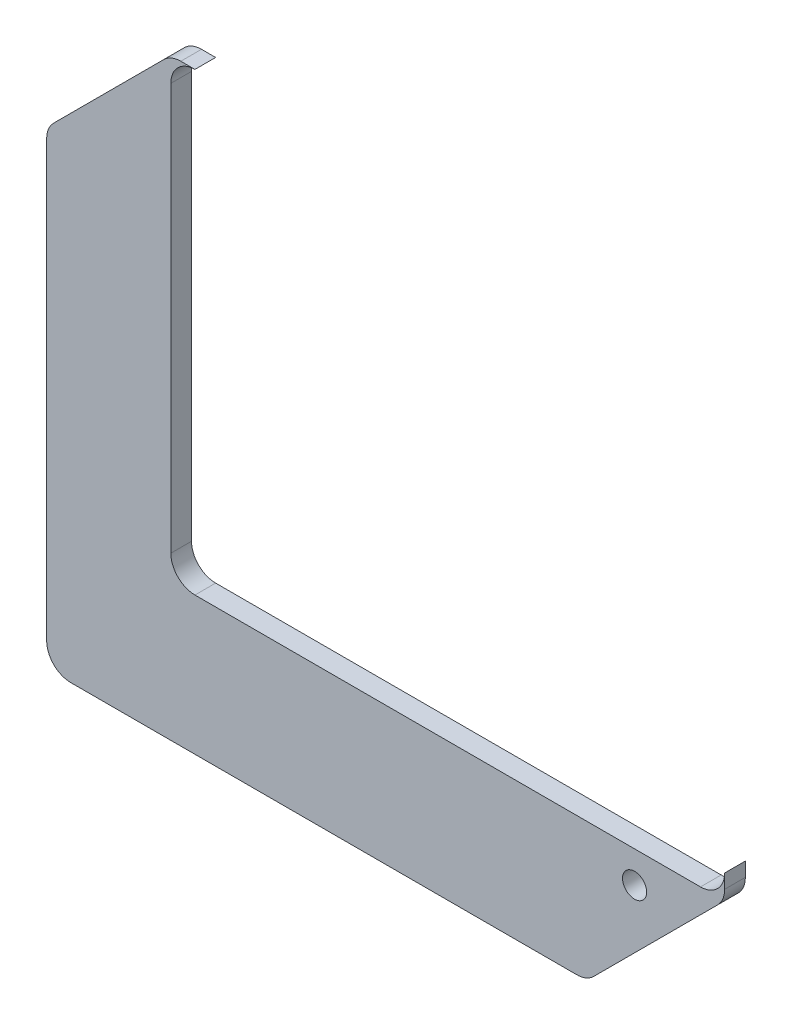
ISO-10303-21;
HEADER;
FILE_DESCRIPTION(('STEP AP214'),'2;1');
FILE_NAME('part.step','',(''),(''),'','','');
FILE_SCHEMA(('AUTOMOTIVE_DESIGN { 1 0 10303 214 1 1 1 1 }'));
ENDSEC;
DATA;
#1=APPLICATION_CONTEXT('core data for automotive mechanical design processes');
#2=APPLICATION_PROTOCOL_DEFINITION('international standard','automotive_design',2000,#1);
#3=PRODUCT_CONTEXT('',#1,'mechanical');
#4=PRODUCT('Part','Part','',(#3));
#5=PRODUCT_RELATED_PRODUCT_CATEGORY('part','',(#4));
#6=PRODUCT_DEFINITION_FORMATION('','',#4);
#7=PRODUCT_DEFINITION_CONTEXT('part definition',#1,'design');
#8=PRODUCT_DEFINITION('design','',#6,#7);
#9=PRODUCT_DEFINITION_SHAPE('','',#8);
#10=(LENGTH_UNIT() NAMED_UNIT(*) SI_UNIT(.MILLI.,.METRE.));
#11=(NAMED_UNIT(*) PLANE_ANGLE_UNIT() SI_UNIT($,.RADIAN.));
#12=(NAMED_UNIT(*) SI_UNIT($,.STERADIAN.) SOLID_ANGLE_UNIT());
#13=UNCERTAINTY_MEASURE_WITH_UNIT(LENGTH_MEASURE(1.E-05),#10,'distance_accuracy_value','');
#14=(GEOMETRIC_REPRESENTATION_CONTEXT(3) GLOBAL_UNCERTAINTY_ASSIGNED_CONTEXT((#13)) GLOBAL_UNIT_ASSIGNED_CONTEXT((#10,
#11,#12)) REPRESENTATION_CONTEXT('',''));
#15=CARTESIAN_POINT('',(0.,0.,0.));
#16=DIRECTION('',(0.,0.,1.));
#17=DIRECTION('',(1.,0.,0.));
#18=AXIS2_PLACEMENT_3D('',#15,#16,#17);
#19=CARTESIAN_POINT('',(40.1499999999999,-40.15,3.));
#20=DIRECTION('',(-0.707106781186546,0.707106781186548,0.));
#21=DIRECTION('',(-0.707106781186549,-0.707106781186546,0.));
#22=AXIS2_PLACEMENT_3D('',#19,#20,#21);
#23=PLANE('',#22);
#24=DIRECTION('',(0.707106781186549,0.707106781186546,0.));
#25=VECTOR('',#24,1.);
#26=CARTESIAN_POINT('',(40.1499999999999,-40.15,0.));
#27=LINE('',#26,#25);
#28=CARTESIAN_POINT('',(61.325126265847,-18.9748737341529,0.));
#29=VERTEX_POINT('',#28);
#30=CARTESIAN_POINT('',(79.2748737341529,-1.02512626584707,0.));
#31=VERTEX_POINT('',#30);
#32=EDGE_CURVE('E188',#29,#31,#27,.T.);
#33=ORIENTED_EDGE('',*,*,#32,.T.);
#34=DIRECTION('',(0.,0.,-1.));
#35=VECTOR('',#34,1.);
#36=CARTESIAN_POINT('',(79.2748737341529,-1.02512626584707,3.));
#37=LINE('',#36,#35);
#38=CARTESIAN_POINT('',(79.2748737341529,-1.02512626584707,3.));
#39=VERTEX_POINT('',#38);
#40=EDGE_CURVE('E241',#31,#39,#37,.F.);
#41=ORIENTED_EDGE('',*,*,#40,.T.);
#42=DIRECTION('',(0.707106781186549,0.707106781186546,0.));
#43=VECTOR('',#42,1.);
#44=CARTESIAN_POINT('',(40.1499999999999,-40.15,3.));
#45=LINE('',#44,#43);
#46=CARTESIAN_POINT('',(61.325126265847,-18.9748737341529,3.));
#47=VERTEX_POINT('',#46);
#48=EDGE_CURVE('E192',#47,#39,#45,.T.);
#49=ORIENTED_EDGE('',*,*,#48,.F.);
#50=DIRECTION('',(0.,0.,-1.));
#51=VECTOR('',#50,1.);
#52=CARTESIAN_POINT('',(61.325126265847,-18.9748737341529,3.));
#53=LINE('',#52,#51);
#54=EDGE_CURVE('E238',#47,#29,#53,.T.);
#55=ORIENTED_EDGE('',*,*,#54,.T.);
#56=EDGE_LOOP('',(#33,#41,#49,#55));
#57=FACE_BOUND('',#56,.T.);
#58=ADVANCED_FACE('F34',(#57),#23,.F.);
#59=CARTESIAN_POINT('',(80.3,0.,3.));
#60=DIRECTION('',(-1.,0.,0.));
#61=DIRECTION('',(0.,0.,1.));
#62=AXIS2_PLACEMENT_3D('',#59,#60,#61);
#63=PLANE('',#62);
#64=DIRECTION('',(0.,1.,0.));
#65=VECTOR('',#64,1.);
#66=CARTESIAN_POINT('',(80.3,0.,0.));
#67=LINE('',#66,#65);
#68=CARTESIAN_POINT('',(80.3,1.44974746830586,0.));
#69=VERTEX_POINT('',#68);
#70=CARTESIAN_POINT('',(80.3,3.50000000000001,0.));
#71=VERTEX_POINT('',#70);
#72=EDGE_CURVE('E214',#69,#71,#67,.T.);
#73=ORIENTED_EDGE('',*,*,#72,.T.);
#74=DIRECTION('',(0.,0.,1.));
#75=VECTOR('',#74,1.);
#76=CARTESIAN_POINT('',(80.3,3.50000000000001,0.));
#77=LINE('',#76,#75);
#78=CARTESIAN_POINT('',(80.3,3.50000000000001,3.));
#79=VERTEX_POINT('',#78);
#80=EDGE_CURVE('E165',#71,#79,#77,.T.);
#81=ORIENTED_EDGE('',*,*,#80,.T.);
#82=DIRECTION('',(0.,1.,0.));
#83=VECTOR('',#82,1.);
#84=CARTESIAN_POINT('',(80.3,0.,3.));
#85=LINE('',#84,#83);
#86=CARTESIAN_POINT('',(80.3,1.44974746830586,3.));
#87=VERTEX_POINT('',#86);
#88=EDGE_CURVE('E195',#87,#79,#85,.T.);
#89=ORIENTED_EDGE('',*,*,#88,.F.);
#90=DIRECTION('',(0.,0.,-1.));
#91=VECTOR('',#90,1.);
#92=CARTESIAN_POINT('',(80.3,1.44974746830586,3.));
#93=LINE('',#92,#91);
#94=EDGE_CURVE('E211',#87,#69,#93,.T.);
#95=ORIENTED_EDGE('',*,*,#94,.T.);
#96=EDGE_LOOP('',(#73,#81,#89,#95));
#97=FACE_BOUND('',#96,.T.);
#98=ADVANCED_FACE('F277',(#97),#63,.F.);
#99=CARTESIAN_POINT('',(0.,66.,3.));
#100=DIRECTION('',(0.,1.,0.));
#101=DIRECTION('',(0.,0.,1.));
#102=AXIS2_PLACEMENT_3D('',#99,#100,#101);
#103=PLANE('',#102);
#104=DIRECTION('',(0.,0.,1.));
#105=VECTOR('',#104,1.);
#106=CARTESIAN_POINT('',(3.5,66.,0.));
#107=LINE('',#106,#105);
#108=CARTESIAN_POINT('',(3.5,66.,0.));
#109=VERTEX_POINT('',#108);
#110=CARTESIAN_POINT('',(3.5,66.,3.));
#111=VERTEX_POINT('',#110);
#112=EDGE_CURVE('E189',#109,#111,#107,.T.);
#113=ORIENTED_EDGE('',*,*,#112,.F.);
#114=DIRECTION('',(1.,0.,0.));
#115=VECTOR('',#114,1.);
#116=CARTESIAN_POINT('',(0.,66.,0.));
#117=LINE('',#116,#115);
#118=CARTESIAN_POINT('',(1.44974746830583,66.,0.));
#119=VERTEX_POINT('',#118);
#120=EDGE_CURVE('E216',#119,#109,#117,.T.);
#121=ORIENTED_EDGE('',*,*,#120,.F.);
#122=DIRECTION('',(0.,0.,-1.));
#123=VECTOR('',#122,1.);
#124=CARTESIAN_POINT('',(1.44974746830583,66.,3.));
#125=LINE('',#124,#123);
#126=CARTESIAN_POINT('',(1.44974746830583,66.,3.));
#127=VERTEX_POINT('',#126);
#128=EDGE_CURVE('E268',#119,#127,#125,.F.);
#129=ORIENTED_EDGE('',*,*,#128,.T.);
#130=DIRECTION('',(1.,0.,0.));
#131=VECTOR('',#130,1.);
#132=CARTESIAN_POINT('',(0.,66.,3.));
#133=LINE('',#132,#131);
#134=EDGE_CURVE('E199',#127,#111,#133,.T.);
#135=ORIENTED_EDGE('',*,*,#134,.T.);
#136=EDGE_LOOP('',(#113,#121,#129,#135));
#137=FACE_BOUND('',#136,.T.);
#138=ADVANCED_FACE('F321',(#137),#103,.T.);
#139=CARTESIAN_POINT('',(-33.,33.0000000000001,3.));
#140=DIRECTION('',(0.707106781186546,-0.707106781186548,0.));
#141=DIRECTION('',(0.707106781186549,0.707106781186546,0.));
#142=AXIS2_PLACEMENT_3D('',#139,#140,#141);
#143=PLANE('',#142);
#144=DIRECTION('',(-0.707106781186549,-0.707106781186546,0.));
#145=VECTOR('',#144,1.);
#146=CARTESIAN_POINT('',(-33.,33.0000000000001,0.));
#147=LINE('',#146,#145);
#148=CARTESIAN_POINT('',(-1.02512626584708,64.9748737341529,0.));
#149=VERTEX_POINT('',#148);
#150=CARTESIAN_POINT('',(-16.9748737341529,49.0251262658471,0.));
#151=VERTEX_POINT('',#150);
#152=EDGE_CURVE('E218',#149,#151,#147,.T.);
#153=ORIENTED_EDGE('',*,*,#152,.T.);
#154=DIRECTION('',(0.,0.,-1.));
#155=VECTOR('',#154,1.);
#156=CARTESIAN_POINT('',(-16.9748737341529,49.0251262658471,3.));
#157=LINE('',#156,#155);
#158=CARTESIAN_POINT('',(-16.9748737341529,49.0251262658471,3.));
#159=VERTEX_POINT('',#158);
#160=EDGE_CURVE('E266',#151,#159,#157,.F.);
#161=ORIENTED_EDGE('',*,*,#160,.T.);
#162=DIRECTION('',(-0.707106781186549,-0.707106781186546,0.));
#163=VECTOR('',#162,1.);
#164=CARTESIAN_POINT('',(-33.,33.0000000000001,3.));
#165=LINE('',#164,#163);
#166=CARTESIAN_POINT('',(-1.02512626584708,64.9748737341529,3.));
#167=VERTEX_POINT('',#166);
#168=EDGE_CURVE('E202',#167,#159,#165,.T.);
#169=ORIENTED_EDGE('',*,*,#168,.F.);
#170=DIRECTION('',(0.,0.,-1.));
#171=VECTOR('',#170,1.);
#172=CARTESIAN_POINT('',(-1.02512626584708,64.9748737341529,0.));
#173=LINE('',#172,#171);
#174=EDGE_CURVE('E263',#167,#149,#173,.T.);
#175=ORIENTED_EDGE('',*,*,#174,.T.);
#176=EDGE_LOOP('',(#153,#161,#169,#175));
#177=FACE_BOUND('',#176,.T.);
#178=ADVANCED_FACE('F311',(#177),#143,.F.);
#179=CARTESIAN_POINT('',(-18.,0.,3.));
#180=DIRECTION('',(1.,0.,0.));
#181=DIRECTION('',(0.,1.,0.));
#182=AXIS2_PLACEMENT_3D('',#179,#180,#181);
#183=PLANE('',#182);
#184=DIRECTION('',(0.,-1.,0.));
#185=VECTOR('',#184,1.);
#186=CARTESIAN_POINT('',(-18.,0.,0.));
#187=LINE('',#186,#185);
#188=CARTESIAN_POINT('',(-18.,46.5502525316942,0.));
#189=VERTEX_POINT('',#188);
#190=CARTESIAN_POINT('',(-18.,-16.5,0.));
#191=VERTEX_POINT('',#190);
#192=EDGE_CURVE('E221',#189,#191,#187,.T.);
#193=ORIENTED_EDGE('',*,*,#192,.T.);
#194=DIRECTION('',(0.,0.,-1.));
#195=VECTOR('',#194,1.);
#196=CARTESIAN_POINT('',(-18.,-16.5,3.));
#197=LINE('',#196,#195);
#198=CARTESIAN_POINT('',(-18.,-16.5,3.));
#199=VERTEX_POINT('',#198);
#200=EDGE_CURVE('E261',#191,#199,#197,.F.);
#201=ORIENTED_EDGE('',*,*,#200,.T.);
#202=DIRECTION('',(0.,-1.,0.));
#203=VECTOR('',#202,1.);
#204=CARTESIAN_POINT('',(-18.,0.,3.));
#205=LINE('',#204,#203);
#206=CARTESIAN_POINT('',(-18.,46.5502525316942,3.));
#207=VERTEX_POINT('',#206);
#208=EDGE_CURVE('E205',#207,#199,#205,.T.);
#209=ORIENTED_EDGE('',*,*,#208,.F.);
#210=DIRECTION('',(0.,0.,-1.));
#211=VECTOR('',#210,1.);
#212=CARTESIAN_POINT('',(-18.,46.5502525316942,3.));
#213=LINE('',#212,#211);
#214=EDGE_CURVE('E258',#207,#189,#213,.T.);
#215=ORIENTED_EDGE('',*,*,#214,.T.);
#216=EDGE_LOOP('',(#193,#201,#209,#215));
#217=FACE_BOUND('',#216,.T.);
#218=ADVANCED_FACE('F302',(#217),#183,.F.);
#219=CARTESIAN_POINT('',(0.,-20.,3.));
#220=DIRECTION('',(0.,1.,0.));
#221=DIRECTION('',(0.,0.,1.));
#222=AXIS2_PLACEMENT_3D('',#219,#220,#221);
#223=PLANE('',#222);
#224=DIRECTION('',(1.,0.,0.));
#225=VECTOR('',#224,1.);
#226=CARTESIAN_POINT('',(0.,-20.,0.));
#227=LINE('',#226,#225);
#228=CARTESIAN_POINT('',(-14.5,-20.,0.));
#229=VERTEX_POINT('',#228);
#230=CARTESIAN_POINT('',(58.8502525316941,-20.,0.));
#231=VERTEX_POINT('',#230);
#232=EDGE_CURVE('E196',#229,#231,#227,.T.);
#233=ORIENTED_EDGE('',*,*,#232,.T.);
#234=DIRECTION('',(0.,0.,-1.));
#235=VECTOR('',#234,1.);
#236=CARTESIAN_POINT('',(58.8502525316941,-20.,3.));
#237=LINE('',#236,#235);
#238=CARTESIAN_POINT('',(58.8502525316941,-20.,3.));
#239=VERTEX_POINT('',#238);
#240=EDGE_CURVE('E256',#231,#239,#237,.F.);
#241=ORIENTED_EDGE('',*,*,#240,.T.);
#242=DIRECTION('',(1.,0.,0.));
#243=VECTOR('',#242,1.);
#244=CARTESIAN_POINT('',(0.,-20.,3.));
#245=LINE('',#244,#243);
#246=CARTESIAN_POINT('',(-14.5,-20.,3.));
#247=VERTEX_POINT('',#246);
#248=EDGE_CURVE('E208',#247,#239,#245,.T.);
#249=ORIENTED_EDGE('',*,*,#248,.F.);
#250=DIRECTION('',(0.,0.,-1.));
#251=VECTOR('',#250,1.);
#252=CARTESIAN_POINT('',(-14.5,-20.,3.));
#253=LINE('',#252,#251);
#254=EDGE_CURVE('E253',#247,#229,#253,.T.);
#255=ORIENTED_EDGE('',*,*,#254,.T.);
#256=EDGE_LOOP('',(#233,#241,#249,#255));
#257=FACE_BOUND('',#256,.T.);
#258=ADVANCED_FACE('F293',(#257),#223,.F.);
#259=CARTESIAN_POINT('',(0.,0.,3.));
#260=DIRECTION('',(0.,0.,1.));
#261=DIRECTION('',(1.,0.,0.));
#262=AXIS2_PLACEMENT_3D('',#259,#260,#261);
#263=PLANE('',#262);
#264=CARTESIAN_POINT('',(67.24,-4.57,3.));
#265=DIRECTION('',(0.,0.,1.));
#266=DIRECTION('',(1.,0.,0.));
#267=AXIS2_PLACEMENT_3D('',#264,#265,#266);
#268=CIRCLE('',#267,1.74999999999999);
#269=CARTESIAN_POINT('',(68.99,-4.57,3.));
#270=VERTEX_POINT('',#269);
#271=EDGE_CURVE('E489',#270,#270,#268,.T.);
#272=ORIENTED_EDGE('',*,*,#271,.F.);
#273=EDGE_LOOP('',(#272));
#274=FACE_BOUND('',#273,.T.);
#275=CARTESIAN_POINT('',(3.5,62.5,3.));
#276=DIRECTION('',(0.,0.,1.));
#277=DIRECTION('',(1.,0.,0.));
#278=AXIS2_PLACEMENT_3D('',#275,#276,#277);
#279=CIRCLE('',#278,3.5);
#280=CARTESIAN_POINT('',(0.,62.5,3.));
#281=VERTEX_POINT('',#280);
#282=EDGE_CURVE('E181',#111,#281,#279,.T.);
#283=ORIENTED_EDGE('',*,*,#282,.F.);
#284=ORIENTED_EDGE('',*,*,#134,.F.);
#285=CARTESIAN_POINT('',(1.44974746830583,62.5,3.));
#286=DIRECTION('',(0.,0.,1.));
#287=DIRECTION('',(1.,0.,0.));
#288=AXIS2_PLACEMENT_3D('',#285,#286,#287);
#289=CIRCLE('',#288,3.5);
#290=EDGE_CURVE('E243',#127,#167,#289,.T.);
#291=ORIENTED_EDGE('',*,*,#290,.T.);
#292=ORIENTED_EDGE('',*,*,#168,.T.);
#293=CARTESIAN_POINT('',(-14.5,46.5502525316942,3.));
#294=DIRECTION('',(0.,0.,1.));
#295=DIRECTION('',(1.,0.,0.));
#296=AXIS2_PLACEMENT_3D('',#293,#294,#295);
#297=CIRCLE('',#296,3.5);
#298=EDGE_CURVE('E245',#159,#207,#297,.T.);
#299=ORIENTED_EDGE('',*,*,#298,.T.);
#300=ORIENTED_EDGE('',*,*,#208,.T.);
#301=CARTESIAN_POINT('',(-14.5,-16.5,3.));
#302=DIRECTION('',(0.,0.,1.));
#303=DIRECTION('',(1.,0.,0.));
#304=AXIS2_PLACEMENT_3D('',#301,#302,#303);
#305=CIRCLE('',#304,3.5);
#306=EDGE_CURVE('E247',#199,#247,#305,.T.);
#307=ORIENTED_EDGE('',*,*,#306,.T.);
#308=ORIENTED_EDGE('',*,*,#248,.T.);
#309=CARTESIAN_POINT('',(58.8502525316941,-16.5,3.));
#310=DIRECTION('',(0.,0.,1.));
#311=DIRECTION('',(1.,0.,0.));
#312=AXIS2_PLACEMENT_3D('',#309,#310,#311);
#313=CIRCLE('',#312,3.5);
#314=EDGE_CURVE('E249',#239,#47,#313,.T.);
#315=ORIENTED_EDGE('',*,*,#314,.T.);
#316=ORIENTED_EDGE('',*,*,#48,.T.);
#317=CARTESIAN_POINT('',(76.8,1.44974746830586,3.));
#318=DIRECTION('',(0.,0.,1.));
#319=DIRECTION('',(1.,0.,0.));
#320=AXIS2_PLACEMENT_3D('',#317,#318,#319);
#321=CIRCLE('',#320,3.5);
#322=EDGE_CURVE('E251',#39,#87,#321,.T.);
#323=ORIENTED_EDGE('',*,*,#322,.T.);
#324=ORIENTED_EDGE('',*,*,#88,.T.);
#325=CARTESIAN_POINT('',(76.8,3.50000000000001,3.));
#326=DIRECTION('',(0.,0.,1.));
#327=DIRECTION('',(1.,0.,0.));
#328=AXIS2_PLACEMENT_3D('',#325,#326,#327);
#329=CIRCLE('',#328,3.50000000000001);
#330=CARTESIAN_POINT('',(76.8,0.,3.));
#331=VERTEX_POINT('',#330);
#332=EDGE_CURVE('E178',#331,#79,#329,.T.);
#333=ORIENTED_EDGE('',*,*,#332,.F.);
#334=DIRECTION('',(1.,0.,0.));
#335=VECTOR('',#334,1.);
#336=CARTESIAN_POINT('',(0.,0.,3.));
#337=LINE('',#336,#335);
#338=CARTESIAN_POINT('',(3.5,0.,3.));
#339=VERTEX_POINT('',#338);
#340=EDGE_CURVE('E162',#339,#331,#337,.T.);
#341=ORIENTED_EDGE('',*,*,#340,.F.);
#342=CARTESIAN_POINT('',(3.5,3.5,3.));
#343=DIRECTION('',(0.,0.,1.));
#344=DIRECTION('',(1.,0.,0.));
#345=AXIS2_PLACEMENT_3D('',#342,#343,#344);
#346=CIRCLE('',#345,3.5);
#347=CARTESIAN_POINT('',(0.,3.5,3.));
#348=VERTEX_POINT('',#347);
#349=EDGE_CURVE('E42',#339,#348,#346,.F.);
#350=ORIENTED_EDGE('',*,*,#349,.T.);
#351=DIRECTION('',(0.,1.,0.));
#352=VECTOR('',#351,1.);
#353=CARTESIAN_POINT('',(0.,0.,3.));
#354=LINE('',#353,#352);
#355=EDGE_CURVE('E157',#348,#281,#354,.T.);
#356=ORIENTED_EDGE('',*,*,#355,.T.);
#357=EDGE_LOOP('',(#283,#284,#291,#292,#299,#300,#307,#308,#315,#316,#323,#324,#333,#341,#350,#356));
#358=FACE_BOUND('',#357,.T.);
#359=ADVANCED_FACE('F274',(#274,#358),#263,.T.);
#360=CARTESIAN_POINT('',(0.,0.,0.));
#361=DIRECTION('',(0.,0.,1.));
#362=DIRECTION('',(1.,0.,0.));
#363=AXIS2_PLACEMENT_3D('',#360,#361,#362);
#364=PLANE('',#363);
#365=CARTESIAN_POINT('',(67.24,-4.57,0.));
#366=DIRECTION('',(0.,0.,1.));
#367=DIRECTION('',(1.,0.,0.));
#368=AXIS2_PLACEMENT_3D('',#365,#366,#367);
#369=CIRCLE('',#368,1.74999999999999);
#370=CARTESIAN_POINT('',(68.99,-4.57,0.));
#371=VERTEX_POINT('',#370);
#372=EDGE_CURVE('E179',#371,#371,#369,.T.);
#373=ORIENTED_EDGE('',*,*,#372,.T.);
#374=EDGE_LOOP('',(#373));
#375=FACE_BOUND('',#374,.T.);
#376=ORIENTED_EDGE('',*,*,#120,.T.);
#377=CARTESIAN_POINT('',(3.5,62.5,0.));
#378=DIRECTION('',(0.,0.,1.));
#379=DIRECTION('',(1.,0.,0.));
#380=AXIS2_PLACEMENT_3D('',#377,#378,#379);
#381=CIRCLE('',#380,3.5);
#382=CARTESIAN_POINT('',(0.,62.5,0.));
#383=VERTEX_POINT('',#382);
#384=EDGE_CURVE('E170',#109,#383,#381,.T.);
#385=ORIENTED_EDGE('',*,*,#384,.T.);
#386=DIRECTION('',(0.,1.,0.));
#387=VECTOR('',#386,1.);
#388=CARTESIAN_POINT('',(0.,0.,0.));
#389=LINE('',#388,#387);
#390=CARTESIAN_POINT('',(0.,3.5,0.));
#391=VERTEX_POINT('',#390);
#392=EDGE_CURVE('E166',#391,#383,#389,.T.);
#393=ORIENTED_EDGE('',*,*,#392,.F.);
#394=CARTESIAN_POINT('',(3.5,3.5,0.));
#395=DIRECTION('',(0.,0.,1.));
#396=DIRECTION('',(1.,0.,0.));
#397=AXIS2_PLACEMENT_3D('',#394,#395,#396);
#398=CIRCLE('',#397,3.5);
#399=CARTESIAN_POINT('',(3.5,0.,0.));
#400=VERTEX_POINT('',#399);
#401=EDGE_CURVE('E11',#391,#400,#398,.T.);
#402=ORIENTED_EDGE('',*,*,#401,.T.);
#403=DIRECTION('',(1.,0.,0.));
#404=VECTOR('',#403,1.);
#405=CARTESIAN_POINT('',(0.,0.,0.));
#406=LINE('',#405,#404);
#407=CARTESIAN_POINT('',(76.8,0.,0.));
#408=VERTEX_POINT('',#407);
#409=EDGE_CURVE('E145',#400,#408,#406,.T.);
#410=ORIENTED_EDGE('',*,*,#409,.T.);
#411=CARTESIAN_POINT('',(76.8,3.50000000000001,0.));
#412=DIRECTION('',(0.,0.,1.));
#413=DIRECTION('',(1.,0.,0.));
#414=AXIS2_PLACEMENT_3D('',#411,#412,#413);
#415=CIRCLE('',#414,3.50000000000001);
#416=EDGE_CURVE('E151',#408,#71,#415,.T.);
#417=ORIENTED_EDGE('',*,*,#416,.T.);
#418=ORIENTED_EDGE('',*,*,#72,.F.);
#419=CARTESIAN_POINT('',(76.8,1.44974746830586,0.));
#420=DIRECTION('',(0.,0.,1.));
#421=DIRECTION('',(1.,0.,0.));
#422=AXIS2_PLACEMENT_3D('',#419,#420,#421);
#423=CIRCLE('',#422,3.5);
#424=EDGE_CURVE('E236',#69,#31,#423,.F.);
#425=ORIENTED_EDGE('',*,*,#424,.T.);
#426=ORIENTED_EDGE('',*,*,#32,.F.);
#427=CARTESIAN_POINT('',(58.8502525316941,-16.5,0.));
#428=DIRECTION('',(0.,0.,1.));
#429=DIRECTION('',(1.,0.,0.));
#430=AXIS2_PLACEMENT_3D('',#427,#428,#429);
#431=CIRCLE('',#430,3.5);
#432=EDGE_CURVE('E234',#29,#231,#431,.F.);
#433=ORIENTED_EDGE('',*,*,#432,.T.);
#434=ORIENTED_EDGE('',*,*,#232,.F.);
#435=CARTESIAN_POINT('',(-14.5,-16.5,0.));
#436=DIRECTION('',(0.,0.,1.));
#437=DIRECTION('',(1.,0.,0.));
#438=AXIS2_PLACEMENT_3D('',#435,#436,#437);
#439=CIRCLE('',#438,3.5);
#440=EDGE_CURVE('E232',#229,#191,#439,.F.);
#441=ORIENTED_EDGE('',*,*,#440,.T.);
#442=ORIENTED_EDGE('',*,*,#192,.F.);
#443=CARTESIAN_POINT('',(-14.5,46.5502525316942,0.));
#444=DIRECTION('',(0.,0.,1.));
#445=DIRECTION('',(1.,0.,0.));
#446=AXIS2_PLACEMENT_3D('',#443,#444,#445);
#447=CIRCLE('',#446,3.5);
#448=EDGE_CURVE('E230',#189,#151,#447,.F.);
#449=ORIENTED_EDGE('',*,*,#448,.T.);
#450=ORIENTED_EDGE('',*,*,#152,.F.);
#451=CARTESIAN_POINT('',(1.44974746830583,62.5,0.));
#452=DIRECTION('',(0.,0.,1.));
#453=DIRECTION('',(1.,0.,0.));
#454=AXIS2_PLACEMENT_3D('',#451,#452,#453);
#455=CIRCLE('',#454,3.5);
#456=EDGE_CURVE('E228',#149,#119,#455,.F.);
#457=ORIENTED_EDGE('',*,*,#456,.T.);
#458=EDGE_LOOP('',(#376,#385,#393,#402,#410,#417,#418,#425,#426,#433,#434,#441,#442,#449,#450,#457));
#459=FACE_BOUND('',#458,.T.);
#460=ADVANCED_FACE('F148',(#375,#459),#364,.F.);
#461=CARTESIAN_POINT('',(76.8,1.44974746830586,3.));
#462=DIRECTION('',(0.,0.,-1.));
#463=DIRECTION('',(-1.,0.,0.));
#464=AXIS2_PLACEMENT_3D('',#461,#462,#463);
#465=CYLINDRICAL_SURFACE('',#464,3.5);
#466=ORIENTED_EDGE('',*,*,#322,.F.);
#467=ORIENTED_EDGE('',*,*,#40,.F.);
#468=ORIENTED_EDGE('',*,*,#424,.F.);
#469=ORIENTED_EDGE('',*,*,#94,.F.);
#470=EDGE_LOOP('',(#466,#467,#468,#469));
#471=FACE_BOUND('',#470,.T.);
#472=ADVANCED_FACE('F286',(#471),#465,.T.);
#473=CARTESIAN_POINT('',(58.8502525316941,-16.5,3.));
#474=DIRECTION('',(0.,0.,-1.));
#475=DIRECTION('',(-1.,0.,0.));
#476=AXIS2_PLACEMENT_3D('',#473,#474,#475);
#477=CYLINDRICAL_SURFACE('',#476,3.5);
#478=ORIENTED_EDGE('',*,*,#314,.F.);
#479=ORIENTED_EDGE('',*,*,#240,.F.);
#480=ORIENTED_EDGE('',*,*,#432,.F.);
#481=ORIENTED_EDGE('',*,*,#54,.F.);
#482=EDGE_LOOP('',(#478,#479,#480,#481));
#483=FACE_BOUND('',#482,.T.);
#484=ADVANCED_FACE('F289',(#483),#477,.T.);
#485=CARTESIAN_POINT('',(-14.5,-16.5,3.));
#486=DIRECTION('',(0.,0.,-1.));
#487=DIRECTION('',(-1.,0.,0.));
#488=AXIS2_PLACEMENT_3D('',#485,#486,#487);
#489=CYLINDRICAL_SURFACE('',#488,3.5);
#490=ORIENTED_EDGE('',*,*,#306,.F.);
#491=ORIENTED_EDGE('',*,*,#200,.F.);
#492=ORIENTED_EDGE('',*,*,#440,.F.);
#493=ORIENTED_EDGE('',*,*,#254,.F.);
#494=EDGE_LOOP('',(#490,#491,#492,#493));
#495=FACE_BOUND('',#494,.T.);
#496=ADVANCED_FACE('F298',(#495),#489,.T.);
#497=CARTESIAN_POINT('',(-14.5,46.5502525316942,3.));
#498=DIRECTION('',(0.,0.,-1.));
#499=DIRECTION('',(-1.,0.,0.));
#500=AXIS2_PLACEMENT_3D('',#497,#498,#499);
#501=CYLINDRICAL_SURFACE('',#500,3.5);
#502=ORIENTED_EDGE('',*,*,#298,.F.);
#503=ORIENTED_EDGE('',*,*,#160,.F.);
#504=ORIENTED_EDGE('',*,*,#448,.F.);
#505=ORIENTED_EDGE('',*,*,#214,.F.);
#506=EDGE_LOOP('',(#502,#503,#504,#505));
#507=FACE_BOUND('',#506,.T.);
#508=ADVANCED_FACE('F307',(#507),#501,.T.);
#509=CARTESIAN_POINT('',(1.44974746830583,62.5,3.));
#510=DIRECTION('',(0.,0.,1.));
#511=DIRECTION('',(1.,0.,0.));
#512=AXIS2_PLACEMENT_3D('',#509,#510,#511);
#513=CYLINDRICAL_SURFACE('',#512,3.5);
#514=ORIENTED_EDGE('',*,*,#290,.F.);
#515=ORIENTED_EDGE('',*,*,#128,.F.);
#516=ORIENTED_EDGE('',*,*,#456,.F.);
#517=ORIENTED_EDGE('',*,*,#174,.F.);
#518=EDGE_LOOP('',(#514,#515,#516,#517));
#519=FACE_BOUND('',#518,.T.);
#520=ADVANCED_FACE('F316',(#519),#513,.T.);
#521=CARTESIAN_POINT('',(0.,0.,0.));
#522=DIRECTION('',(0.,-1.,0.));
#523=DIRECTION('',(0.,0.,-1.));
#524=AXIS2_PLACEMENT_3D('',#521,#522,#523);
#525=PLANE('',#524);
#526=ORIENTED_EDGE('',*,*,#409,.F.);
#527=DIRECTION('',(0.,0.,1.));
#528=VECTOR('',#527,1.);
#529=CARTESIAN_POINT('',(3.5,0.,0.));
#530=LINE('',#529,#528);
#531=EDGE_CURVE('E270',#400,#339,#530,.T.);
#532=ORIENTED_EDGE('',*,*,#531,.T.);
#533=ORIENTED_EDGE('',*,*,#340,.T.);
#534=DIRECTION('',(0.,0.,1.));
#535=VECTOR('',#534,1.);
#536=CARTESIAN_POINT('',(76.8,0.,0.));
#537=LINE('',#536,#535);
#538=EDGE_CURVE('E160',#408,#331,#537,.T.);
#539=ORIENTED_EDGE('',*,*,#538,.F.);
#540=EDGE_LOOP('',(#526,#532,#533,#539));
#541=FACE_BOUND('',#540,.T.);
#542=ADVANCED_FACE('F161',(#541),#525,.F.);
#543=CARTESIAN_POINT('',(0.,0.,0.));
#544=DIRECTION('',(1.,0.,0.));
#545=DIRECTION('',(0.,0.,-1.));
#546=AXIS2_PLACEMENT_3D('',#543,#544,#545);
#547=PLANE('',#546);
#548=ORIENTED_EDGE('',*,*,#355,.F.);
#549=DIRECTION('',(0.,0.,1.));
#550=VECTOR('',#549,1.);
#551=CARTESIAN_POINT('',(0.,3.5,0.));
#552=LINE('',#551,#550);
#553=EDGE_CURVE('E49',#348,#391,#552,.F.);
#554=ORIENTED_EDGE('',*,*,#553,.T.);
#555=ORIENTED_EDGE('',*,*,#392,.T.);
#556=DIRECTION('',(0.,0.,1.));
#557=VECTOR('',#556,1.);
#558=CARTESIAN_POINT('',(0.,62.5,0.));
#559=LINE('',#558,#557);
#560=EDGE_CURVE('E185',#383,#281,#559,.T.);
#561=ORIENTED_EDGE('',*,*,#560,.T.);
#562=EDGE_LOOP('',(#548,#554,#555,#561));
#563=FACE_BOUND('',#562,.T.);
#564=ADVANCED_FACE('F326',(#563),#547,.T.);
#565=CARTESIAN_POINT('',(3.5,62.5,0.));
#566=DIRECTION('',(0.,0.,1.));
#567=DIRECTION('',(1.,0.,0.));
#568=AXIS2_PLACEMENT_3D('',#565,#566,#567);
#569=CYLINDRICAL_SURFACE('',#568,3.5);
#570=ORIENTED_EDGE('',*,*,#282,.T.);
#571=ORIENTED_EDGE('',*,*,#560,.F.);
#572=ORIENTED_EDGE('',*,*,#384,.F.);
#573=ORIENTED_EDGE('',*,*,#112,.T.);
#574=EDGE_LOOP('',(#570,#571,#572,#573));
#575=FACE_BOUND('',#574,.T.);
#576=ADVANCED_FACE('F324',(#575),#569,.F.);
#577=CARTESIAN_POINT('',(76.8,3.50000000000001,0.));
#578=DIRECTION('',(0.,0.,1.));
#579=DIRECTION('',(1.,0.,0.));
#580=AXIS2_PLACEMENT_3D('',#577,#578,#579);
#581=CYLINDRICAL_SURFACE('',#580,3.50000000000001);
#582=ORIENTED_EDGE('',*,*,#332,.T.);
#583=ORIENTED_EDGE('',*,*,#80,.F.);
#584=ORIENTED_EDGE('',*,*,#416,.F.);
#585=ORIENTED_EDGE('',*,*,#538,.T.);
#586=EDGE_LOOP('',(#582,#583,#584,#585));
#587=FACE_BOUND('',#586,.T.);
#588=ADVANCED_FACE('F168',(#587),#581,.F.);
#589=CARTESIAN_POINT('',(3.5,3.5,0.));
#590=DIRECTION('',(0.,0.,1.));
#591=DIRECTION('',(1.,0.,0.));
#592=AXIS2_PLACEMENT_3D('',#589,#590,#591);
#593=CYLINDRICAL_SURFACE('',#592,3.5);
#594=ORIENTED_EDGE('',*,*,#401,.F.);
#595=ORIENTED_EDGE('',*,*,#553,.F.);
#596=ORIENTED_EDGE('',*,*,#349,.F.);
#597=ORIENTED_EDGE('',*,*,#531,.F.);
#598=EDGE_LOOP('',(#594,#595,#596,#597));
#599=FACE_BOUND('',#598,.T.);
#600=ADVANCED_FACE('F36',(#599),#593,.F.);
#601=CARTESIAN_POINT('',(67.24,-4.57,3.));
#602=DIRECTION('',(0.,0.,1.));
#603=DIRECTION('',(1.,0.,0.));
#604=AXIS2_PLACEMENT_3D('',#601,#602,#603);
#605=CYLINDRICAL_SURFACE('',#604,1.74999999999999);
#606=ORIENTED_EDGE('',*,*,#372,.F.);
#607=EDGE_LOOP('',(#606));
#608=FACE_BOUND('',#607,.T.);
#609=ORIENTED_EDGE('',*,*,#271,.T.);
#610=EDGE_LOOP('',(#609));
#611=FACE_BOUND('',#610,.T.);
#612=ADVANCED_FACE('F328',(#608,#611),#605,.F.);
#613=CLOSED_SHELL('',(#58,#98,#138,#178,#218,#258,#359,#460,#472,#484,#496,#508,#520,#542,#564,
#576,#588,#600,#612));
#614=MANIFOLD_SOLID_BREP('B2',#613);
#615=ADVANCED_BREP_SHAPE_REPRESENTATION('',(#18,#614),#14);
#616=SHAPE_DEFINITION_REPRESENTATION(#9,#615);
ENDSEC;
END-ISO-10303-21;
